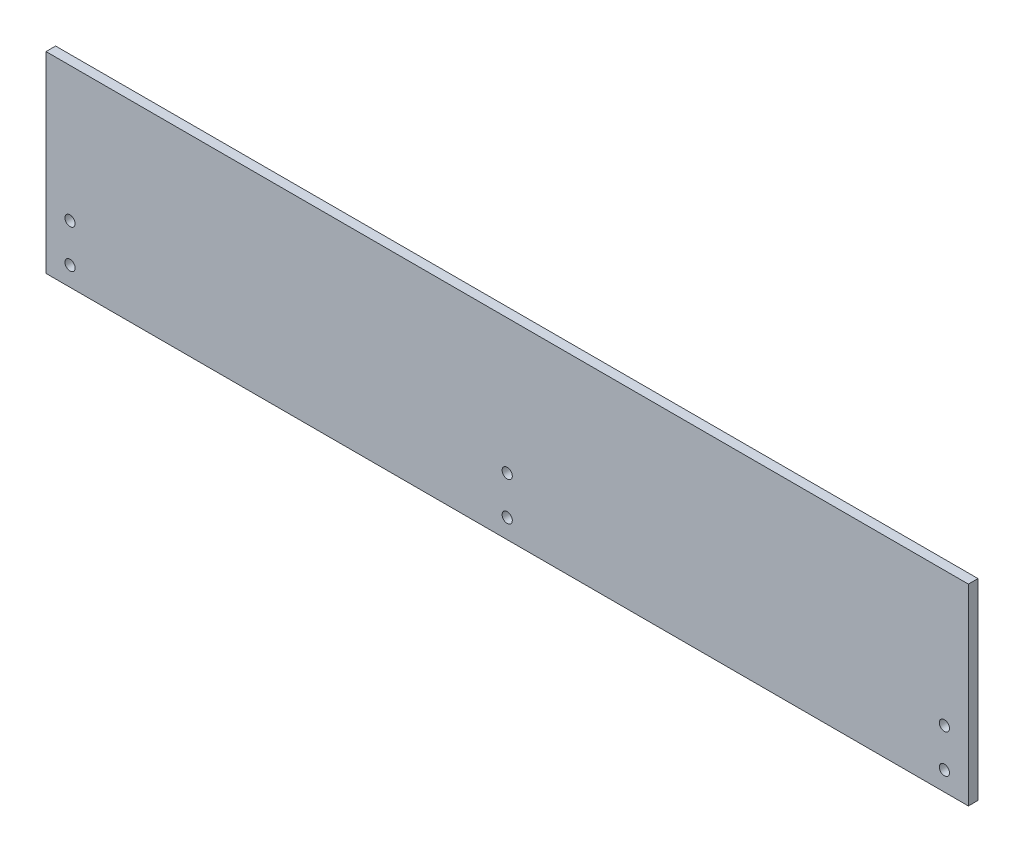
ISO-10303-21;
HEADER;
FILE_DESCRIPTION(('STEP AP214'),'2;1');
FILE_NAME('part.step','',(''),(''),'','','');
FILE_SCHEMA(('AUTOMOTIVE_DESIGN { 1 0 10303 214 1 1 1 1 }'));
ENDSEC;
DATA;
#1=APPLICATION_CONTEXT('core data for automotive mechanical design processes');
#2=APPLICATION_PROTOCOL_DEFINITION('international standard','automotive_design',2000,#1);
#3=PRODUCT_CONTEXT('',#1,'mechanical');
#4=PRODUCT('Part','Part','',(#3));
#5=PRODUCT_RELATED_PRODUCT_CATEGORY('part','',(#4));
#6=PRODUCT_DEFINITION_FORMATION('','',#4);
#7=PRODUCT_DEFINITION_CONTEXT('part definition',#1,'design');
#8=PRODUCT_DEFINITION('design','',#6,#7);
#9=PRODUCT_DEFINITION_SHAPE('','',#8);
#10=(LENGTH_UNIT() NAMED_UNIT(*) SI_UNIT(.MILLI.,.METRE.));
#11=(NAMED_UNIT(*) PLANE_ANGLE_UNIT() SI_UNIT($,.RADIAN.));
#12=(NAMED_UNIT(*) SI_UNIT($,.STERADIAN.) SOLID_ANGLE_UNIT());
#13=UNCERTAINTY_MEASURE_WITH_UNIT(LENGTH_MEASURE(1.E-05),#10,'distance_accuracy_value','');
#14=(GEOMETRIC_REPRESENTATION_CONTEXT(3) GLOBAL_UNCERTAINTY_ASSIGNED_CONTEXT((#13)) GLOBAL_UNIT_ASSIGNED_CONTEXT((#10,
#11,#12)) REPRESENTATION_CONTEXT('',''));
#15=CARTESIAN_POINT('',(0.,0.,0.));
#16=DIRECTION('',(0.,0.,1.));
#17=DIRECTION('',(1.,0.,0.));
#18=AXIS2_PLACEMENT_3D('',#15,#16,#17);
#19=CARTESIAN_POINT('',(0.,0.,6.35));
#20=DIRECTION('',(1.,0.,0.));
#21=DIRECTION('',(0.,1.,0.));
#22=AXIS2_PLACEMENT_3D('',#19,#20,#21);
#23=PLANE('',#22);
#24=DIRECTION('',(0.,-1.,0.));
#25=VECTOR('',#24,1.);
#26=CARTESIAN_POINT('',(0.,0.,0.));
#27=LINE('',#26,#25);
#28=CARTESIAN_POINT('',(-1.11022302462516E-13,127.,0.));
#29=VERTEX_POINT('',#28);
#30=CARTESIAN_POINT('',(0.,0.,0.));
#31=VERTEX_POINT('',#30);
#32=EDGE_CURVE('E111',#29,#31,#27,.T.);
#33=ORIENTED_EDGE('',*,*,#32,.T.);
#34=DIRECTION('',(0.,0.,-1.));
#35=VECTOR('',#34,1.);
#36=CARTESIAN_POINT('',(0.,0.,6.35));
#37=LINE('',#36,#35);
#38=CARTESIAN_POINT('',(0.,0.,6.35));
#39=VERTEX_POINT('',#38);
#40=EDGE_CURVE('E11',#39,#31,#37,.T.);
#41=ORIENTED_EDGE('',*,*,#40,.F.);
#42=DIRECTION('',(0.,-1.,0.));
#43=VECTOR('',#42,1.);
#44=CARTESIAN_POINT('',(0.,0.,6.35));
#45=LINE('',#44,#43);
#46=CARTESIAN_POINT('',(-1.11022302462516E-13,127.,6.35));
#47=VERTEX_POINT('',#46);
#48=EDGE_CURVE('E94',#47,#39,#45,.T.);
#49=ORIENTED_EDGE('',*,*,#48,.F.);
#50=DIRECTION('',(0.,0.,-1.));
#51=VECTOR('',#50,1.);
#52=CARTESIAN_POINT('',(-1.11022302462516E-13,127.,6.35));
#53=LINE('',#52,#51);
#54=EDGE_CURVE('E107',#47,#29,#53,.T.);
#55=ORIENTED_EDGE('',*,*,#54,.T.);
#56=EDGE_LOOP('',(#33,#41,#49,#55));
#57=FACE_BOUND('',#56,.T.);
#58=ADVANCED_FACE('F42',(#57),#23,.F.);
#59=CARTESIAN_POINT('',(0.,0.,6.35));
#60=DIRECTION('',(0.,1.,0.));
#61=DIRECTION('',(0.,0.,1.));
#62=AXIS2_PLACEMENT_3D('',#59,#60,#61);
#63=PLANE('',#62);
#64=DIRECTION('',(1.,0.,0.));
#65=VECTOR('',#64,1.);
#66=CARTESIAN_POINT('',(0.,0.,0.));
#67=LINE('',#66,#65);
#68=CARTESIAN_POINT('',(609.6,0.,0.));
#69=VERTEX_POINT('',#68);
#70=EDGE_CURVE('E99',#31,#69,#67,.T.);
#71=ORIENTED_EDGE('',*,*,#70,.T.);
#72=DIRECTION('',(0.,0.,-1.));
#73=VECTOR('',#72,1.);
#74=CARTESIAN_POINT('',(609.6,0.,6.35));
#75=LINE('',#74,#73);
#76=CARTESIAN_POINT('',(609.6,0.,6.35));
#77=VERTEX_POINT('',#76);
#78=EDGE_CURVE('E51',#77,#69,#75,.T.);
#79=ORIENTED_EDGE('',*,*,#78,.F.);
#80=DIRECTION('',(1.,0.,0.));
#81=VECTOR('',#80,1.);
#82=CARTESIAN_POINT('',(0.,0.,6.35));
#83=LINE('',#82,#81);
#84=EDGE_CURVE('E89',#39,#77,#83,.T.);
#85=ORIENTED_EDGE('',*,*,#84,.F.);
#86=ORIENTED_EDGE('',*,*,#40,.T.);
#87=EDGE_LOOP('',(#71,#79,#85,#86));
#88=FACE_BOUND('',#87,.T.);
#89=ADVANCED_FACE('F98',(#88),#63,.F.);
#90=CARTESIAN_POINT('',(609.6,0.,6.35));
#91=DIRECTION('',(-1.,0.,0.));
#92=DIRECTION('',(0.,-1.,0.));
#93=AXIS2_PLACEMENT_3D('',#90,#91,#92);
#94=PLANE('',#93);
#95=DIRECTION('',(0.,1.,0.));
#96=VECTOR('',#95,1.);
#97=CARTESIAN_POINT('',(609.6,0.,0.));
#98=LINE('',#97,#96);
#99=CARTESIAN_POINT('',(609.6,127.,0.));
#100=VERTEX_POINT('',#99);
#101=EDGE_CURVE('E76',#69,#100,#98,.T.);
#102=ORIENTED_EDGE('',*,*,#101,.T.);
#103=DIRECTION('',(0.,0.,-1.));
#104=VECTOR('',#103,1.);
#105=CARTESIAN_POINT('',(609.6,127.,6.35));
#106=LINE('',#105,#104);
#107=CARTESIAN_POINT('',(609.6,127.,6.35));
#108=VERTEX_POINT('',#107);
#109=EDGE_CURVE('E101',#108,#100,#106,.T.);
#110=ORIENTED_EDGE('',*,*,#109,.F.);
#111=DIRECTION('',(0.,1.,0.));
#112=VECTOR('',#111,1.);
#113=CARTESIAN_POINT('',(609.6,0.,6.35));
#114=LINE('',#113,#112);
#115=EDGE_CURVE('E92',#77,#108,#114,.T.);
#116=ORIENTED_EDGE('',*,*,#115,.F.);
#117=ORIENTED_EDGE('',*,*,#78,.T.);
#118=EDGE_LOOP('',(#102,#110,#116,#117));
#119=FACE_BOUND('',#118,.T.);
#120=ADVANCED_FACE('F102',(#119),#94,.F.);
#121=CARTESIAN_POINT('',(-1.11022302462516E-13,127.,6.35));
#122=DIRECTION('',(0.,-1.,0.));
#123=DIRECTION('',(0.,0.,-1.));
#124=AXIS2_PLACEMENT_3D('',#121,#122,#123);
#125=PLANE('',#124);
#126=DIRECTION('',(-1.,0.,0.));
#127=VECTOR('',#126,1.);
#128=CARTESIAN_POINT('',(-1.11022302462516E-13,127.,0.));
#129=LINE('',#128,#127);
#130=EDGE_CURVE('E82',#100,#29,#129,.T.);
#131=ORIENTED_EDGE('',*,*,#130,.T.);
#132=ORIENTED_EDGE('',*,*,#54,.F.);
#133=DIRECTION('',(-1.,0.,0.));
#134=VECTOR('',#133,1.);
#135=CARTESIAN_POINT('',(-1.11022302462516E-13,127.,6.35));
#136=LINE('',#135,#134);
#137=EDGE_CURVE('E59',#108,#47,#136,.T.);
#138=ORIENTED_EDGE('',*,*,#137,.F.);
#139=ORIENTED_EDGE('',*,*,#109,.T.);
#140=EDGE_LOOP('',(#131,#132,#138,#139));
#141=FACE_BOUND('',#140,.T.);
#142=ADVANCED_FACE('F126',(#141),#125,.F.);
#143=CARTESIAN_POINT('',(0.,0.,6.35));
#144=DIRECTION('',(0.,0.,-1.));
#145=DIRECTION('',(-1.,0.,0.));
#146=AXIS2_PLACEMENT_3D('',#143,#144,#145);
#147=PLANE('',#146);
#148=CARTESIAN_POINT('',(304.8,38.1,6.35));
#149=DIRECTION('',(0.,0.,1.));
#150=DIRECTION('',(1.,0.,0.));
#151=AXIS2_PLACEMENT_3D('',#148,#149,#150);
#152=CIRCLE('',#151,3.36550000000002);
#153=CARTESIAN_POINT('',(308.1655,38.1,6.35));
#154=VERTEX_POINT('',#153);
#155=EDGE_CURVE('E174',#154,#154,#152,.T.);
#156=ORIENTED_EDGE('',*,*,#155,.F.);
#157=EDGE_LOOP('',(#156));
#158=FACE_BOUND('',#157,.T.);
#159=CARTESIAN_POINT('',(304.8,12.7,6.35));
#160=DIRECTION('',(0.,0.,1.));
#161=DIRECTION('',(1.,0.,0.));
#162=AXIS2_PLACEMENT_3D('',#159,#160,#161);
#163=CIRCLE('',#162,3.36550000000002);
#164=CARTESIAN_POINT('',(308.1655,12.7,6.35));
#165=VERTEX_POINT('',#164);
#166=EDGE_CURVE('E170',#165,#165,#163,.T.);
#167=ORIENTED_EDGE('',*,*,#166,.F.);
#168=EDGE_LOOP('',(#167));
#169=FACE_BOUND('',#168,.T.);
#170=CARTESIAN_POINT('',(15.8749999999999,38.1,6.35));
#171=DIRECTION('',(0.,0.,1.));
#172=DIRECTION('',(1.,0.,0.));
#173=AXIS2_PLACEMENT_3D('',#170,#171,#172);
#174=CIRCLE('',#173,3.3655);
#175=CARTESIAN_POINT('',(19.2404999999999,38.1,6.35));
#176=VERTEX_POINT('',#175);
#177=EDGE_CURVE('E142',#176,#176,#174,.T.);
#178=ORIENTED_EDGE('',*,*,#177,.F.);
#179=EDGE_LOOP('',(#178));
#180=FACE_BOUND('',#179,.T.);
#181=CARTESIAN_POINT('',(593.725,38.1,6.35));
#182=DIRECTION('',(0.,0.,1.));
#183=DIRECTION('',(1.,0.,0.));
#184=AXIS2_PLACEMENT_3D('',#181,#182,#183);
#185=CIRCLE('',#184,3.36550000000002);
#186=CARTESIAN_POINT('',(597.0905,38.1,6.35));
#187=VERTEX_POINT('',#186);
#188=EDGE_CURVE('E151',#187,#187,#185,.T.);
#189=ORIENTED_EDGE('',*,*,#188,.F.);
#190=EDGE_LOOP('',(#189));
#191=FACE_BOUND('',#190,.T.);
#192=CARTESIAN_POINT('',(593.725,12.7,6.35));
#193=DIRECTION('',(0.,0.,1.));
#194=DIRECTION('',(1.,0.,0.));
#195=AXIS2_PLACEMENT_3D('',#192,#193,#194);
#196=CIRCLE('',#195,3.36550000000002);
#197=CARTESIAN_POINT('',(597.0905,12.7,6.35));
#198=VERTEX_POINT('',#197);
#199=EDGE_CURVE('E159',#198,#198,#196,.T.);
#200=ORIENTED_EDGE('',*,*,#199,.F.);
#201=EDGE_LOOP('',(#200));
#202=FACE_BOUND('',#201,.T.);
#203=CARTESIAN_POINT('',(15.8749999999999,12.7,6.35));
#204=DIRECTION('',(0.,0.,1.));
#205=DIRECTION('',(1.,0.,0.));
#206=AXIS2_PLACEMENT_3D('',#203,#204,#205);
#207=CIRCLE('',#206,3.3655);
#208=CARTESIAN_POINT('',(19.2404999999999,12.7,6.35));
#209=VERTEX_POINT('',#208);
#210=EDGE_CURVE('E134',#209,#209,#207,.T.);
#211=ORIENTED_EDGE('',*,*,#210,.F.);
#212=EDGE_LOOP('',(#211));
#213=FACE_BOUND('',#212,.T.);
#214=ORIENTED_EDGE('',*,*,#48,.T.);
#215=ORIENTED_EDGE('',*,*,#84,.T.);
#216=ORIENTED_EDGE('',*,*,#115,.T.);
#217=ORIENTED_EDGE('',*,*,#137,.T.);
#218=EDGE_LOOP('',(#214,#215,#216,#217));
#219=FACE_BOUND('',#218,.T.);
#220=ADVANCED_FACE('F90',(#158,#169,#180,#191,#202,#213,#219),#147,.F.);
#221=CARTESIAN_POINT('',(0.,0.,0.));
#222=DIRECTION('',(0.,0.,-1.));
#223=DIRECTION('',(-1.,0.,0.));
#224=AXIS2_PLACEMENT_3D('',#221,#222,#223);
#225=PLANE('',#224);
#226=CARTESIAN_POINT('',(304.8,38.1,0.));
#227=DIRECTION('',(0.,0.,1.));
#228=DIRECTION('',(1.,0.,0.));
#229=AXIS2_PLACEMENT_3D('',#226,#227,#228);
#230=CIRCLE('',#229,3.36550000000002);
#231=CARTESIAN_POINT('',(308.1655,38.1,0.));
#232=VERTEX_POINT('',#231);
#233=EDGE_CURVE('E147',#232,#232,#230,.T.);
#234=ORIENTED_EDGE('',*,*,#233,.T.);
#235=EDGE_LOOP('',(#234));
#236=FACE_BOUND('',#235,.T.);
#237=CARTESIAN_POINT('',(304.8,12.7,0.));
#238=DIRECTION('',(0.,0.,1.));
#239=DIRECTION('',(1.,0.,0.));
#240=AXIS2_PLACEMENT_3D('',#237,#238,#239);
#241=CIRCLE('',#240,3.36550000000002);
#242=CARTESIAN_POINT('',(308.1655,12.7,0.));
#243=VERTEX_POINT('',#242);
#244=EDGE_CURVE('E166',#243,#243,#241,.T.);
#245=ORIENTED_EDGE('',*,*,#244,.T.);
#246=EDGE_LOOP('',(#245));
#247=FACE_BOUND('',#246,.T.);
#248=CARTESIAN_POINT('',(15.8749999999999,38.1,0.));
#249=DIRECTION('',(0.,0.,1.));
#250=DIRECTION('',(1.,0.,0.));
#251=AXIS2_PLACEMENT_3D('',#248,#249,#250);
#252=CIRCLE('',#251,3.3655);
#253=CARTESIAN_POINT('',(19.2404999999999,38.1,0.));
#254=VERTEX_POINT('',#253);
#255=EDGE_CURVE('E146',#254,#254,#252,.T.);
#256=ORIENTED_EDGE('',*,*,#255,.T.);
#257=EDGE_LOOP('',(#256));
#258=FACE_BOUND('',#257,.T.);
#259=CARTESIAN_POINT('',(593.725,38.1,0.));
#260=DIRECTION('',(0.,0.,1.));
#261=DIRECTION('',(1.,0.,0.));
#262=AXIS2_PLACEMENT_3D('',#259,#260,#261);
#263=CIRCLE('',#262,3.36550000000002);
#264=CARTESIAN_POINT('',(597.0905,38.1,0.));
#265=VERTEX_POINT('',#264);
#266=EDGE_CURVE('E155',#265,#265,#263,.T.);
#267=ORIENTED_EDGE('',*,*,#266,.T.);
#268=EDGE_LOOP('',(#267));
#269=FACE_BOUND('',#268,.T.);
#270=CARTESIAN_POINT('',(593.725,12.7,0.));
#271=DIRECTION('',(0.,0.,1.));
#272=DIRECTION('',(1.,0.,0.));
#273=AXIS2_PLACEMENT_3D('',#270,#271,#272);
#274=CIRCLE('',#273,3.36550000000002);
#275=CARTESIAN_POINT('',(597.0905,12.7,0.));
#276=VERTEX_POINT('',#275);
#277=EDGE_CURVE('E138',#276,#276,#274,.T.);
#278=ORIENTED_EDGE('',*,*,#277,.T.);
#279=EDGE_LOOP('',(#278));
#280=FACE_BOUND('',#279,.T.);
#281=CARTESIAN_POINT('',(15.8749999999999,12.7,0.));
#282=DIRECTION('',(0.,0.,1.));
#283=DIRECTION('',(1.,0.,0.));
#284=AXIS2_PLACEMENT_3D('',#281,#282,#283);
#285=CIRCLE('',#284,3.3655);
#286=CARTESIAN_POINT('',(19.2404999999999,12.7,0.));
#287=VERTEX_POINT('',#286);
#288=EDGE_CURVE('E115',#287,#287,#285,.T.);
#289=ORIENTED_EDGE('',*,*,#288,.T.);
#290=EDGE_LOOP('',(#289));
#291=FACE_BOUND('',#290,.T.);
#292=ORIENTED_EDGE('',*,*,#32,.F.);
#293=ORIENTED_EDGE('',*,*,#130,.F.);
#294=ORIENTED_EDGE('',*,*,#101,.F.);
#295=ORIENTED_EDGE('',*,*,#70,.F.);
#296=EDGE_LOOP('',(#292,#293,#294,#295));
#297=FACE_BOUND('',#296,.T.);
#298=ADVANCED_FACE('F129',(#236,#247,#258,#269,#280,#291,#297),#225,.T.);
#299=CARTESIAN_POINT('',(15.8749999999999,12.7,0.));
#300=DIRECTION('',(0.,0.,1.));
#301=DIRECTION('',(1.,0.,0.));
#302=AXIS2_PLACEMENT_3D('',#299,#300,#301);
#303=CYLINDRICAL_SURFACE('',#302,3.3655);
#304=ORIENTED_EDGE('',*,*,#288,.F.);
#305=EDGE_LOOP('',(#304));
#306=FACE_BOUND('',#305,.T.);
#307=ORIENTED_EDGE('',*,*,#210,.T.);
#308=EDGE_LOOP('',(#307));
#309=FACE_BOUND('',#308,.T.);
#310=ADVANCED_FACE('F205',(#306,#309),#303,.F.);
#311=CARTESIAN_POINT('',(593.725,12.7,0.));
#312=DIRECTION('',(0.,0.,1.));
#313=DIRECTION('',(1.,0.,0.));
#314=AXIS2_PLACEMENT_3D('',#311,#312,#313);
#315=CYLINDRICAL_SURFACE('',#314,3.36550000000002);
#316=ORIENTED_EDGE('',*,*,#277,.F.);
#317=EDGE_LOOP('',(#316));
#318=FACE_BOUND('',#317,.T.);
#319=ORIENTED_EDGE('',*,*,#199,.T.);
#320=EDGE_LOOP('',(#319));
#321=FACE_BOUND('',#320,.T.);
#322=ADVANCED_FACE('F207',(#318,#321),#315,.F.);
#323=CARTESIAN_POINT('',(593.725,38.1,0.));
#324=DIRECTION('',(0.,0.,1.));
#325=DIRECTION('',(1.,0.,0.));
#326=AXIS2_PLACEMENT_3D('',#323,#324,#325);
#327=CYLINDRICAL_SURFACE('',#326,3.36550000000002);
#328=ORIENTED_EDGE('',*,*,#266,.F.);
#329=EDGE_LOOP('',(#328));
#330=FACE_BOUND('',#329,.T.);
#331=ORIENTED_EDGE('',*,*,#188,.T.);
#332=EDGE_LOOP('',(#331));
#333=FACE_BOUND('',#332,.T.);
#334=ADVANCED_FACE('F214',(#330,#333),#327,.F.);
#335=CARTESIAN_POINT('',(15.8749999999999,38.1,0.));
#336=DIRECTION('',(0.,0.,1.));
#337=DIRECTION('',(1.,0.,0.));
#338=AXIS2_PLACEMENT_3D('',#335,#336,#337);
#339=CYLINDRICAL_SURFACE('',#338,3.3655);
#340=ORIENTED_EDGE('',*,*,#255,.F.);
#341=EDGE_LOOP('',(#340));
#342=FACE_BOUND('',#341,.T.);
#343=ORIENTED_EDGE('',*,*,#177,.T.);
#344=EDGE_LOOP('',(#343));
#345=FACE_BOUND('',#344,.T.);
#346=ADVANCED_FACE('F254',(#342,#345),#339,.F.);
#347=CARTESIAN_POINT('',(304.8,12.7,0.));
#348=DIRECTION('',(0.,0.,1.));
#349=DIRECTION('',(1.,0.,0.));
#350=AXIS2_PLACEMENT_3D('',#347,#348,#349);
#351=CYLINDRICAL_SURFACE('',#350,3.36550000000002);
#352=ORIENTED_EDGE('',*,*,#244,.F.);
#353=EDGE_LOOP('',(#352));
#354=FACE_BOUND('',#353,.T.);
#355=ORIENTED_EDGE('',*,*,#166,.T.);
#356=EDGE_LOOP('',(#355));
#357=FACE_BOUND('',#356,.T.);
#358=ADVANCED_FACE('F188',(#354,#357),#351,.F.);
#359=CARTESIAN_POINT('',(304.8,38.1,0.));
#360=DIRECTION('',(0.,0.,1.));
#361=DIRECTION('',(1.,0.,0.));
#362=AXIS2_PLACEMENT_3D('',#359,#360,#361);
#363=CYLINDRICAL_SURFACE('',#362,3.36550000000002);
#364=ORIENTED_EDGE('',*,*,#233,.F.);
#365=EDGE_LOOP('',(#364));
#366=FACE_BOUND('',#365,.T.);
#367=ORIENTED_EDGE('',*,*,#155,.T.);
#368=EDGE_LOOP('',(#367));
#369=FACE_BOUND('',#368,.T.);
#370=ADVANCED_FACE('F185',(#366,#369),#363,.F.);
#371=CLOSED_SHELL('',(#58,#89,#120,#142,#220,#298,#310,#322,#334,#346,#358,#370));
#372=MANIFOLD_SOLID_BREP('B2',#371);
#373=ADVANCED_BREP_SHAPE_REPRESENTATION('',(#18,#372),#14);
#374=SHAPE_DEFINITION_REPRESENTATION(#9,#373);
ENDSEC;
END-ISO-10303-21;
